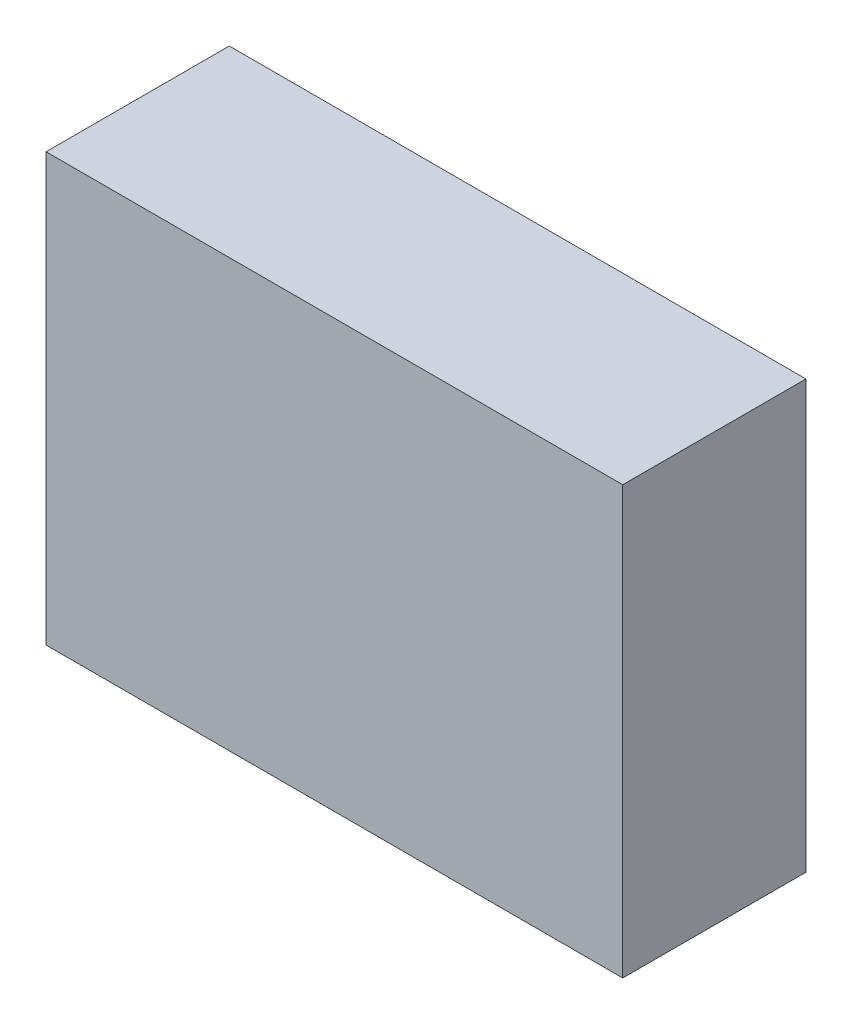
ISO-10303-21;
HEADER;
FILE_DESCRIPTION(('STEP AP214'),'2;1');
FILE_NAME('part.step','',(''),(''),'','','');
FILE_SCHEMA(('AUTOMOTIVE_DESIGN { 1 0 10303 214 1 1 1 1 }'));
ENDSEC;
DATA;
#1=APPLICATION_CONTEXT('core data for automotive mechanical design processes');
#2=APPLICATION_PROTOCOL_DEFINITION('international standard','automotive_design',2000,#1);
#3=PRODUCT_CONTEXT('',#1,'mechanical');
#4=PRODUCT('Part','Part','',(#3));
#5=PRODUCT_RELATED_PRODUCT_CATEGORY('part','',(#4));
#6=PRODUCT_DEFINITION_FORMATION('','',#4);
#7=PRODUCT_DEFINITION_CONTEXT('part definition',#1,'design');
#8=PRODUCT_DEFINITION('design','',#6,#7);
#9=PRODUCT_DEFINITION_SHAPE('','',#8);
#10=(LENGTH_UNIT() NAMED_UNIT(*) SI_UNIT(.MILLI.,.METRE.));
#11=(NAMED_UNIT(*) PLANE_ANGLE_UNIT() SI_UNIT($,.RADIAN.));
#12=(NAMED_UNIT(*) SI_UNIT($,.STERADIAN.) SOLID_ANGLE_UNIT());
#13=UNCERTAINTY_MEASURE_WITH_UNIT(LENGTH_MEASURE(1.E-05),#10,'distance_accuracy_value','');
#14=(GEOMETRIC_REPRESENTATION_CONTEXT(3) GLOBAL_UNCERTAINTY_ASSIGNED_CONTEXT((#13)) GLOBAL_UNIT_ASSIGNED_CONTEXT((#10,
#11,#12)) REPRESENTATION_CONTEXT('',''));
#15=CARTESIAN_POINT('',(0.,0.,0.));
#16=DIRECTION('',(0.,0.,1.));
#17=DIRECTION('',(1.,0.,0.));
#18=AXIS2_PLACEMENT_3D('',#15,#16,#17);
#19=CARTESIAN_POINT('',(-1.18050818,-0.87448898,0.));
#20=DIRECTION('',(-1.,0.,0.));
#21=DIRECTION('',(0.,1.,0.));
#22=AXIS2_PLACEMENT_3D('',#19,#20,#21);
#23=PLANE('',#22);
#24=DIRECTION('',(0.,0.,1.));
#25=VECTOR('',#24,1.);
#26=CARTESIAN_POINT('',(-1.18050818,-0.87448898,0.));
#27=LINE('',#26,#25);
#28=CARTESIAN_POINT('',(-1.18050818,-0.87448898,0.));
#29=VERTEX_POINT('',#28);
#30=CARTESIAN_POINT('',(-1.18050818,-0.87448898,0.75000104));
#31=VERTEX_POINT('',#30);
#32=EDGE_CURVE('E11',#29,#31,#27,.T.);
#33=ORIENTED_EDGE('',*,*,#32,.T.);
#34=DIRECTION('',(0.,1.,0.));
#35=VECTOR('',#34,1.);
#36=CARTESIAN_POINT('',(-1.18050818,-0.87448898,0.75000104));
#37=LINE('',#36,#35);
#38=CARTESIAN_POINT('',(-1.18050818,0.87449152,0.75000104));
#39=VERTEX_POINT('',#38);
#40=EDGE_CURVE('E23',#31,#39,#37,.T.);
#41=ORIENTED_EDGE('',*,*,#40,.T.);
#42=DIRECTION('',(0.,0.,1.));
#43=VECTOR('',#42,1.);
#44=CARTESIAN_POINT('',(-1.18050818,0.87449152,0.));
#45=LINE('',#44,#43);
#46=CARTESIAN_POINT('',(-1.18050818,0.87449152,0.));
#47=VERTEX_POINT('',#46);
#48=EDGE_CURVE('E84',#47,#39,#45,.T.);
#49=ORIENTED_EDGE('',*,*,#48,.F.);
#50=DIRECTION('',(0.,1.,0.));
#51=VECTOR('',#50,1.);
#52=CARTESIAN_POINT('',(-1.18050818,-0.87448898,0.));
#53=LINE('',#52,#51);
#54=EDGE_CURVE('E82',#29,#47,#53,.T.);
#55=ORIENTED_EDGE('',*,*,#54,.F.);
#56=EDGE_LOOP('',(#33,#41,#49,#55));
#57=FACE_BOUND('',#56,.T.);
#58=ADVANCED_FACE('F16',(#57),#23,.T.);
#59=CARTESIAN_POINT('',(-1.18050818,0.87449152,0.));
#60=DIRECTION('',(0.,1.,0.));
#61=DIRECTION('',(1.,0.,0.));
#62=AXIS2_PLACEMENT_3D('',#59,#60,#61);
#63=PLANE('',#62);
#64=ORIENTED_EDGE('',*,*,#48,.T.);
#65=DIRECTION('',(1.,0.,0.));
#66=VECTOR('',#65,1.);
#67=CARTESIAN_POINT('',(-1.18050818,0.87449152,0.75000104));
#68=LINE('',#67,#66);
#69=CARTESIAN_POINT('',(1.18051072,0.87449152,0.75000104));
#70=VERTEX_POINT('',#69);
#71=EDGE_CURVE('E80',#39,#70,#68,.T.);
#72=ORIENTED_EDGE('',*,*,#71,.T.);
#73=DIRECTION('',(0.,0.,1.));
#74=VECTOR('',#73,1.);
#75=CARTESIAN_POINT('',(1.18051072,0.87449152,0.));
#76=LINE('',#75,#74);
#77=CARTESIAN_POINT('',(1.18051072,0.87449152,0.));
#78=VERTEX_POINT('',#77);
#79=EDGE_CURVE('E78',#78,#70,#76,.T.);
#80=ORIENTED_EDGE('',*,*,#79,.F.);
#81=DIRECTION('',(1.,0.,0.));
#82=VECTOR('',#81,1.);
#83=CARTESIAN_POINT('',(-1.18050818,0.87449152,0.));
#84=LINE('',#83,#82);
#85=EDGE_CURVE('E69',#47,#78,#84,.T.);
#86=ORIENTED_EDGE('',*,*,#85,.F.);
#87=EDGE_LOOP('',(#64,#72,#80,#86));
#88=FACE_BOUND('',#87,.T.);
#89=ADVANCED_FACE('F89',(#88),#63,.T.);
#90=CARTESIAN_POINT('',(1.18051072,0.87449152,0.));
#91=DIRECTION('',(0.999999999998946,-1.45227462341292E-06,0.));
#92=DIRECTION('',(-1.45227462341292E-06,-0.999999999998946,0.));
#93=AXIS2_PLACEMENT_3D('',#90,#91,#92);
#94=PLANE('',#93);
#95=ORIENTED_EDGE('',*,*,#79,.T.);
#96=DIRECTION('',(-1.45227462341292E-06,-0.999999999998946,0.));
#97=VECTOR('',#96,1.);
#98=CARTESIAN_POINT('',(1.18051072,0.87449152,0.75000104));
#99=LINE('',#98,#97);
#100=CARTESIAN_POINT('',(1.18050818,-0.87448898,0.75000104));
#101=VERTEX_POINT('',#100);
#102=EDGE_CURVE('E59',#70,#101,#99,.T.);
#103=ORIENTED_EDGE('',*,*,#102,.T.);
#104=DIRECTION('',(0.,0.,1.));
#105=VECTOR('',#104,1.);
#106=CARTESIAN_POINT('',(1.18050818,-0.87448898,0.));
#107=LINE('',#106,#105);
#108=CARTESIAN_POINT('',(1.18050818,-0.87448898,0.));
#109=VERTEX_POINT('',#108);
#110=EDGE_CURVE('E53',#109,#101,#107,.T.);
#111=ORIENTED_EDGE('',*,*,#110,.F.);
#112=DIRECTION('',(-1.45227462341292E-06,-0.999999999998946,0.));
#113=VECTOR('',#112,1.);
#114=CARTESIAN_POINT('',(1.18051072,0.87449152,0.));
#115=LINE('',#114,#113);
#116=EDGE_CURVE('E57',#78,#109,#115,.T.);
#117=ORIENTED_EDGE('',*,*,#116,.F.);
#118=EDGE_LOOP('',(#95,#103,#111,#117));
#119=FACE_BOUND('',#118,.T.);
#120=ADVANCED_FACE('F56',(#119),#94,.T.);
#121=CARTESIAN_POINT('',(1.18050818,-0.87448898,0.));
#122=DIRECTION('',(0.,-1.,0.));
#123=DIRECTION('',(-1.,0.,0.));
#124=AXIS2_PLACEMENT_3D('',#121,#122,#123);
#125=PLANE('',#124);
#126=ORIENTED_EDGE('',*,*,#110,.T.);
#127=DIRECTION('',(-1.,0.,0.));
#128=VECTOR('',#127,1.);
#129=CARTESIAN_POINT('',(1.18050818,-0.87448898,0.75000104));
#130=LINE('',#129,#128);
#131=EDGE_CURVE('E70',#101,#31,#130,.T.);
#132=ORIENTED_EDGE('',*,*,#131,.T.);
#133=ORIENTED_EDGE('',*,*,#32,.F.);
#134=DIRECTION('',(-1.,0.,0.));
#135=VECTOR('',#134,1.);
#136=CARTESIAN_POINT('',(1.18050818,-0.87448898,0.));
#137=LINE('',#136,#135);
#138=EDGE_CURVE('E67',#109,#29,#137,.T.);
#139=ORIENTED_EDGE('',*,*,#138,.F.);
#140=EDGE_LOOP('',(#126,#132,#133,#139));
#141=FACE_BOUND('',#140,.T.);
#142=ADVANCED_FACE('F72',(#141),#125,.T.);
#143=CARTESIAN_POINT('',(-1.18050818,-0.87448898,0.));
#144=DIRECTION('',(0.,0.,1.));
#145=DIRECTION('',(1.,0.,0.));
#146=AXIS2_PLACEMENT_3D('',#143,#144,#145);
#147=PLANE('',#146);
#148=ORIENTED_EDGE('',*,*,#54,.T.);
#149=ORIENTED_EDGE('',*,*,#85,.T.);
#150=ORIENTED_EDGE('',*,*,#116,.T.);
#151=ORIENTED_EDGE('',*,*,#138,.T.);
#152=EDGE_LOOP('',(#148,#149,#150,#151));
#153=FACE_BOUND('',#152,.T.);
#154=ADVANCED_FACE('F66',(#153),#147,.F.);
#155=CARTESIAN_POINT('',(-1.18050818,-0.87448898,0.75000104));
#156=DIRECTION('',(0.,0.,1.));
#157=DIRECTION('',(1.,0.,0.));
#158=AXIS2_PLACEMENT_3D('',#155,#156,#157);
#159=PLANE('',#158);
#160=ORIENTED_EDGE('',*,*,#131,.F.);
#161=ORIENTED_EDGE('',*,*,#102,.F.);
#162=ORIENTED_EDGE('',*,*,#71,.F.);
#163=ORIENTED_EDGE('',*,*,#40,.F.);
#164=EDGE_LOOP('',(#160,#161,#162,#163));
#165=FACE_BOUND('',#164,.T.);
#166=ADVANCED_FACE('F90',(#165),#159,.T.);
#167=CLOSED_SHELL('',(#58,#89,#120,#142,#154,#166));
#168=MANIFOLD_SOLID_BREP('B1',#167);
#169=ADVANCED_BREP_SHAPE_REPRESENTATION('',(#18,#168),#14);
#170=SHAPE_DEFINITION_REPRESENTATION(#9,#169);
ENDSEC;
END-ISO-10303-21;
